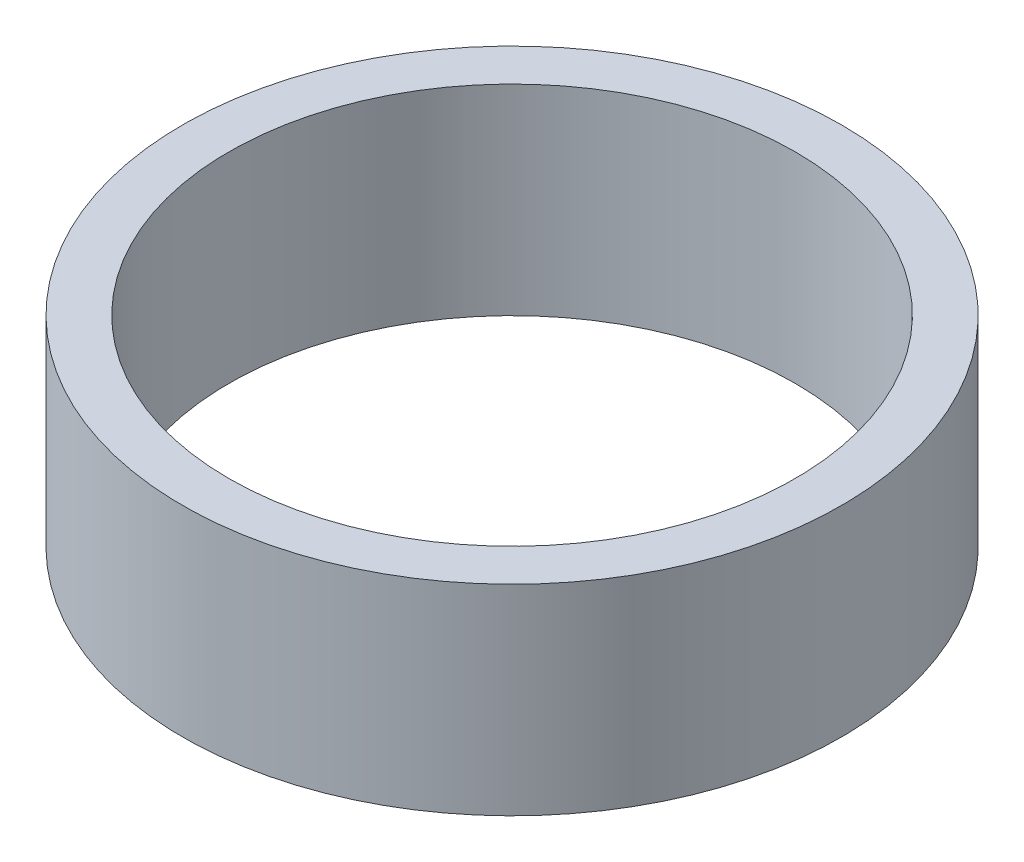
ISO-10303-21;
HEADER;
FILE_DESCRIPTION(('STEP AP214'),'2;1');
FILE_NAME('part.step','',(''),(''),'','','');
FILE_SCHEMA(('AUTOMOTIVE_DESIGN { 1 0 10303 214 1 1 1 1 }'));
ENDSEC;
DATA;
#1=APPLICATION_CONTEXT('core data for automotive mechanical design processes');
#2=APPLICATION_PROTOCOL_DEFINITION('international standard','automotive_design',2000,#1);
#3=PRODUCT_CONTEXT('',#1,'mechanical');
#4=PRODUCT('Part','Part','',(#3));
#5=PRODUCT_RELATED_PRODUCT_CATEGORY('part','',(#4));
#6=PRODUCT_DEFINITION_FORMATION('','',#4);
#7=PRODUCT_DEFINITION_CONTEXT('part definition',#1,'design');
#8=PRODUCT_DEFINITION('design','',#6,#7);
#9=PRODUCT_DEFINITION_SHAPE('','',#8);
#10=(LENGTH_UNIT() NAMED_UNIT(*) SI_UNIT(.MILLI.,.METRE.));
#11=(NAMED_UNIT(*) PLANE_ANGLE_UNIT() SI_UNIT($,.RADIAN.));
#12=(NAMED_UNIT(*) SI_UNIT($,.STERADIAN.) SOLID_ANGLE_UNIT());
#13=UNCERTAINTY_MEASURE_WITH_UNIT(LENGTH_MEASURE(1.E-05),#10,'distance_accuracy_value','');
#14=(GEOMETRIC_REPRESENTATION_CONTEXT(3) GLOBAL_UNCERTAINTY_ASSIGNED_CONTEXT((#13)) GLOBAL_UNIT_ASSIGNED_CONTEXT((#10,
#11,#12)) REPRESENTATION_CONTEXT('',''));
#15=CARTESIAN_POINT('',(0.,0.,0.));
#16=DIRECTION('',(0.,0.,1.));
#17=DIRECTION('',(1.,0.,0.));
#18=AXIS2_PLACEMENT_3D('',#15,#16,#17);
#19=CARTESIAN_POINT('',(0.,13.6926559928297,0.));
#20=DIRECTION('',(0.,-1.,0.));
#21=DIRECTION('',(0.,0.,-1.));
#22=AXIS2_PLACEMENT_3D('',#19,#20,#21);
#23=CYLINDRICAL_SURFACE('',#22,22.5);
#24=CARTESIAN_POINT('',(0.,13.6926559928297,0.));
#25=DIRECTION('',(0.,1.,0.));
#26=DIRECTION('',(0.,0.,1.));
#27=AXIS2_PLACEMENT_3D('',#24,#25,#26);
#28=CIRCLE('',#27,22.5);
#29=CARTESIAN_POINT('',(0.,13.6926559928297,-22.5));
#30=VERTEX_POINT('',#29);
#31=EDGE_CURVE('E10',#30,#30,#28,.T.);
#32=CARTESIAN_POINT('',(0.,0.,0.));
#33=DIRECTION('',(0.,1.,0.));
#34=DIRECTION('',(0.,0.,1.));
#35=AXIS2_PLACEMENT_3D('',#32,#33,#34);
#36=CIRCLE('',#35,22.5);
#37=CARTESIAN_POINT('',(0.,0.,-22.5));
#38=VERTEX_POINT('',#37);
#39=EDGE_CURVE('E37',#38,#38,#36,.T.);
#40=CARTESIAN_POINT('',(0.,13.6926559928297,-22.5));
#41=CARTESIAN_POINT('',(0.,13.5500241595711,-22.5));
#42=CARTESIAN_POINT('',(0.,13.4073923263124,-22.5));
#43=CARTESIAN_POINT('',(0.,13.1221286597951,-22.5));
#44=CARTESIAN_POINT('',(0.,12.9794968265365,-22.5));
#45=CARTESIAN_POINT('',(0.,12.6942331600192,-22.5));
#46=CARTESIAN_POINT('',(0.,12.5516013267606,-22.5));
#47=CARTESIAN_POINT('',(0.,12.2663376602433,-22.5));
#48=CARTESIAN_POINT('',(0.,12.1237058269846,-22.5));
#49=CARTESIAN_POINT('',(0.,11.8384421604673,-22.5));
#50=CARTESIAN_POINT('',(0.,11.6958103272087,-22.5));
#51=CARTESIAN_POINT('',(0.,11.4105466606914,-22.5));
#52=CARTESIAN_POINT('',(0.,11.2679148274328,-22.5));
#53=CARTESIAN_POINT('',(0.,10.9826511609155,-22.5));
#54=CARTESIAN_POINT('',(0.,10.8400193276568,-22.5));
#55=CARTESIAN_POINT('',(0.,10.5547556611396,-22.5));
#56=CARTESIAN_POINT('',(0.,10.4121238278809,-22.5));
#57=CARTESIAN_POINT('',(0.,10.1268601613636,-22.5));
#58=CARTESIAN_POINT('',(0.,9.98422832810498,-22.5));
#59=CARTESIAN_POINT('',(0.,9.6989646615877,-22.5));
#60=CARTESIAN_POINT('',(0.,9.55633282832906,-22.5));
#61=CARTESIAN_POINT('',(0.,9.27106916181177,-22.5));
#62=CARTESIAN_POINT('',(0.,9.12843732855313,-22.5));
#63=CARTESIAN_POINT('',(0.,8.84317366203584,-22.5));
#64=CARTESIAN_POINT('',(0.,8.7005418287772,-22.5));
#65=CARTESIAN_POINT('',(0.,8.41527816225992,-22.5));
#66=CARTESIAN_POINT('',(0.,8.27264632900127,-22.5));
#67=CARTESIAN_POINT('',(0.,7.98738266248399,-22.5));
#68=CARTESIAN_POINT('',(0.,7.84475082922535,-22.5));
#69=CARTESIAN_POINT('',(0.,7.55948716270806,-22.5));
#70=CARTESIAN_POINT('',(0.,7.41685532944942,-22.5));
#71=CARTESIAN_POINT('',(0.,7.13159166293213,-22.5));
#72=CARTESIAN_POINT('',(0.,6.98895982967349,-22.5));
#73=CARTESIAN_POINT('',(0.,6.7036961631562,-22.5));
#74=CARTESIAN_POINT('',(0.,6.56106432989756,-22.5));
#75=CARTESIAN_POINT('',(0.,6.27580066338028,-22.5));
#76=CARTESIAN_POINT('',(0.,6.13316883012163,-22.5));
#77=CARTESIAN_POINT('',(0.,5.84790516360435,-22.5));
#78=CARTESIAN_POINT('',(0.,5.70527333034571,-22.5));
#79=CARTESIAN_POINT('',(0.,5.42000966382842,-22.5));
#80=CARTESIAN_POINT('',(0.,5.27737783056978,-22.5));
#81=CARTESIAN_POINT('',(0.,4.99211416405249,-22.5));
#82=CARTESIAN_POINT('',(0.,4.84948233079385,-22.5));
#83=CARTESIAN_POINT('',(0.,4.56421866427656,-22.5));
#84=CARTESIAN_POINT('',(0.,4.42158683101792,-22.5));
#85=CARTESIAN_POINT('',(0.,4.13632316450064,-22.5));
#86=CARTESIAN_POINT('',(0.,3.99369133124199,-22.5));
#87=CARTESIAN_POINT('',(0.,3.70842766472471,-22.5));
#88=CARTESIAN_POINT('',(0.,3.56579583146607,-22.5));
#89=CARTESIAN_POINT('',(0.,3.28053216494878,-22.5));
#90=CARTESIAN_POINT('',(0.,3.13790033169014,-22.5));
#91=CARTESIAN_POINT('',(0.,2.85263666517285,-22.5));
#92=CARTESIAN_POINT('',(0.,2.71000483191421,-22.5));
#93=CARTESIAN_POINT('',(0.,2.42474116539692,-22.5));
#94=CARTESIAN_POINT('',(0.,2.28210933213828,-22.5));
#95=CARTESIAN_POINT('',(0.,1.996845665621,-22.5));
#96=CARTESIAN_POINT('',(0.,1.85421383236235,-22.5));
#97=CARTESIAN_POINT('',(0.,1.56895016584507,-22.5));
#98=CARTESIAN_POINT('',(0.,1.42631833258643,-22.5));
#99=CARTESIAN_POINT('',(0.,1.14105466606914,-22.5));
#100=CARTESIAN_POINT('',(0.,0.998422832810498,-22.5));
#101=CARTESIAN_POINT('',(0.,0.713159166293212,-22.5));
#102=CARTESIAN_POINT('',(0.,0.570527333034569,-22.5));
#103=CARTESIAN_POINT('',(0.,0.285263666517284,-22.5));
#104=CARTESIAN_POINT('',(0.,0.142631833258641,-22.5));
#105=CARTESIAN_POINT('',(0.,0.,-22.5));
#106=B_SPLINE_CURVE_WITH_KNOTS('',3,(#40,#41,#42,#43,#44,#45,#46,#47,#48,#49,#50,#51,#52,#53,
#54,#55,#56,#57,#58,#59,#60,#61,#62,#63,#64,#65,#66,#67,#68,#69,#70,#71,#72,#73,#74,#75,#76,#77,
#78,#79,#80,#81,#82,#83,#84,#85,#86,#87,#88,#89,#90,#91,#92,#93,#94,#95,#96,#97,#98,#99,#100,
#101,#102,#103,#104,#105),.UNSPECIFIED.,.F.,.F.,(4,2,2,2,2,2,2,2,2,2,2,2,2,2,2,2,2,2,2,2,2,2,2,
2,2,2,2,2,2,2,2,2,4),(0.,0.427895499775927,0.855790999551855,1.28368649932778,1.71158199910371,
2.13947749887964,2.56737299865557,2.99526849843149,3.42316399820742,3.85105949798335,
4.27895499775928,4.70685049753521,5.13474599731113,5.56264149708706,5.99053699686299,
6.41843249663892,6.84632799641485,7.27422349619077,7.7021189959667,8.13001449574263,
8.55790999551856,8.98580549529449,9.41370099507042,9.84159649484634,10.2694919946223,
10.6973874943982,11.1252829941741,11.5531784939501,11.981073993726,12.4089694935019,
12.8368649932778,13.2647604930538,13.6926559928297),.UNSPECIFIED.);
#107=EDGE_CURVE('BSEAM40',#30,#38,#106,.T.);
#108=ORIENTED_EDGE('',*,*,#31,.F.);
#109=ORIENTED_EDGE('',*,*,#39,.T.);
#110=ORIENTED_EDGE('',*,*,#107,.T.);
#111=ORIENTED_EDGE('',*,*,#107,.F.);
#112=EDGE_LOOP('',(#108,#110,#109,#111));
#113=FACE_BOUND('',#112,.T.);
#114=ADVANCED_FACE('F40',(#113),#23,.T.);
#115=CARTESIAN_POINT('',(0.,13.6926559928297,0.));
#116=DIRECTION('',(0.,1.,0.));
#117=DIRECTION('',(0.,0.,1.));
#118=AXIS2_PLACEMENT_3D('',#115,#116,#117);
#119=PLANE('',#118);
#120=CARTESIAN_POINT('',(0.,13.6926559928297,0.));
#121=DIRECTION('',(0.,1.,0.));
#122=DIRECTION('',(0.,0.,1.));
#123=AXIS2_PLACEMENT_3D('',#120,#121,#122);
#124=CIRCLE('',#123,19.3259621114039);
#125=CARTESIAN_POINT('',(0.,13.6926559928297,-19.3259621114039));
#126=VERTEX_POINT('',#125);
#127=EDGE_CURVE('E50',#126,#126,#124,.T.);
#128=ORIENTED_EDGE('',*,*,#127,.F.);
#129=EDGE_LOOP('',(#128));
#130=FACE_BOUND('',#129,.T.);
#131=ORIENTED_EDGE('',*,*,#31,.T.);
#132=EDGE_LOOP('',(#131));
#133=FACE_BOUND('',#132,.T.);
#134=ADVANCED_FACE('F59',(#130,#133),#119,.T.);
#135=CARTESIAN_POINT('',(0.,0.,0.));
#136=DIRECTION('',(0.,1.,0.));
#137=DIRECTION('',(0.,0.,1.));
#138=AXIS2_PLACEMENT_3D('',#135,#136,#137);
#139=PLANE('',#138);
#140=CARTESIAN_POINT('',(0.,0.,0.));
#141=DIRECTION('',(0.,1.,0.));
#142=DIRECTION('',(0.,0.,1.));
#143=AXIS2_PLACEMENT_3D('',#140,#141,#142);
#144=CIRCLE('',#143,19.3259621114039);
#145=CARTESIAN_POINT('',(0.,0.,-19.3259621114039));
#146=VERTEX_POINT('',#145);
#147=EDGE_CURVE('E47',#146,#146,#144,.T.);
#148=ORIENTED_EDGE('',*,*,#147,.T.);
#149=EDGE_LOOP('',(#148));
#150=FACE_BOUND('',#149,.T.);
#151=ORIENTED_EDGE('',*,*,#39,.F.);
#152=EDGE_LOOP('',(#151));
#153=FACE_BOUND('',#152,.T.);
#154=ADVANCED_FACE('F58',(#150,#153),#139,.F.);
#155=CARTESIAN_POINT('',(0.,13.6926559928297,0.));
#156=DIRECTION('',(0.,-1.,0.));
#157=DIRECTION('',(0.,0.,-1.));
#158=AXIS2_PLACEMENT_3D('',#155,#156,#157);
#159=CYLINDRICAL_SURFACE('',#158,19.3259621114039);
#160=CARTESIAN_POINT('',(0.,13.6926559928297,-19.3259621114039));
#161=CARTESIAN_POINT('',(0.,13.5500241595711,-19.3259621114039));
#162=CARTESIAN_POINT('',(0.,13.4073923263124,-19.3259621114039));
#163=CARTESIAN_POINT('',(0.,13.1221286597951,-19.3259621114039));
#164=CARTESIAN_POINT('',(0.,12.9794968265365,-19.3259621114039));
#165=CARTESIAN_POINT('',(0.,12.6942331600192,-19.3259621114039));
#166=CARTESIAN_POINT('',(0.,12.5516013267606,-19.3259621114039));
#167=CARTESIAN_POINT('',(0.,12.2663376602433,-19.3259621114039));
#168=CARTESIAN_POINT('',(0.,12.1237058269846,-19.3259621114039));
#169=CARTESIAN_POINT('',(0.,11.8384421604673,-19.3259621114039));
#170=CARTESIAN_POINT('',(0.,11.6958103272087,-19.3259621114039));
#171=CARTESIAN_POINT('',(0.,11.4105466606914,-19.3259621114039));
#172=CARTESIAN_POINT('',(0.,11.2679148274328,-19.3259621114039));
#173=CARTESIAN_POINT('',(0.,10.9826511609155,-19.3259621114039));
#174=CARTESIAN_POINT('',(0.,10.8400193276568,-19.3259621114039));
#175=CARTESIAN_POINT('',(0.,10.5547556611396,-19.3259621114039));
#176=CARTESIAN_POINT('',(0.,10.4121238278809,-19.3259621114039));
#177=CARTESIAN_POINT('',(0.,10.1268601613636,-19.3259621114039));
#178=CARTESIAN_POINT('',(0.,9.98422832810498,-19.3259621114039));
#179=CARTESIAN_POINT('',(0.,9.6989646615877,-19.3259621114039));
#180=CARTESIAN_POINT('',(0.,9.55633282832906,-19.3259621114039));
#181=CARTESIAN_POINT('',(0.,9.27106916181177,-19.3259621114039));
#182=CARTESIAN_POINT('',(0.,9.12843732855313,-19.3259621114039));
#183=CARTESIAN_POINT('',(0.,8.84317366203584,-19.3259621114039));
#184=CARTESIAN_POINT('',(0.,8.7005418287772,-19.3259621114039));
#185=CARTESIAN_POINT('',(0.,8.41527816225992,-19.3259621114039));
#186=CARTESIAN_POINT('',(0.,8.27264632900127,-19.3259621114039));
#187=CARTESIAN_POINT('',(0.,7.98738266248399,-19.3259621114039));
#188=CARTESIAN_POINT('',(0.,7.84475082922535,-19.3259621114039));
#189=CARTESIAN_POINT('',(0.,7.55948716270806,-19.3259621114039));
#190=CARTESIAN_POINT('',(0.,7.41685532944942,-19.3259621114039));
#191=CARTESIAN_POINT('',(0.,7.13159166293213,-19.3259621114039));
#192=CARTESIAN_POINT('',(0.,6.98895982967349,-19.3259621114039));
#193=CARTESIAN_POINT('',(0.,6.7036961631562,-19.3259621114039));
#194=CARTESIAN_POINT('',(0.,6.56106432989756,-19.3259621114039));
#195=CARTESIAN_POINT('',(0.,6.27580066338028,-19.3259621114039));
#196=CARTESIAN_POINT('',(0.,6.13316883012163,-19.3259621114039));
#197=CARTESIAN_POINT('',(0.,5.84790516360435,-19.3259621114039));
#198=CARTESIAN_POINT('',(0.,5.70527333034571,-19.3259621114039));
#199=CARTESIAN_POINT('',(0.,5.42000966382842,-19.3259621114039));
#200=CARTESIAN_POINT('',(0.,5.27737783056978,-19.3259621114039));
#201=CARTESIAN_POINT('',(0.,4.99211416405249,-19.3259621114039));
#202=CARTESIAN_POINT('',(0.,4.84948233079385,-19.3259621114039));
#203=CARTESIAN_POINT('',(0.,4.56421866427656,-19.3259621114039));
#204=CARTESIAN_POINT('',(0.,4.42158683101792,-19.3259621114039));
#205=CARTESIAN_POINT('',(0.,4.13632316450064,-19.3259621114039));
#206=CARTESIAN_POINT('',(0.,3.99369133124199,-19.3259621114039));
#207=CARTESIAN_POINT('',(0.,3.70842766472471,-19.3259621114039));
#208=CARTESIAN_POINT('',(0.,3.56579583146607,-19.3259621114039));
#209=CARTESIAN_POINT('',(0.,3.28053216494878,-19.3259621114039));
#210=CARTESIAN_POINT('',(0.,3.13790033169014,-19.3259621114039));
#211=CARTESIAN_POINT('',(0.,2.85263666517285,-19.3259621114039));
#212=CARTESIAN_POINT('',(0.,2.71000483191421,-19.3259621114039));
#213=CARTESIAN_POINT('',(0.,2.42474116539692,-19.3259621114039));
#214=CARTESIAN_POINT('',(0.,2.28210933213828,-19.3259621114039));
#215=CARTESIAN_POINT('',(0.,1.996845665621,-19.3259621114039));
#216=CARTESIAN_POINT('',(0.,1.85421383236235,-19.3259621114039));
#217=CARTESIAN_POINT('',(0.,1.56895016584507,-19.3259621114039));
#218=CARTESIAN_POINT('',(0.,1.42631833258643,-19.3259621114039));
#219=CARTESIAN_POINT('',(0.,1.14105466606914,-19.3259621114039));
#220=CARTESIAN_POINT('',(0.,0.998422832810498,-19.3259621114039));
#221=CARTESIAN_POINT('',(0.,0.713159166293212,-19.3259621114039));
#222=CARTESIAN_POINT('',(0.,0.570527333034569,-19.3259621114039));
#223=CARTESIAN_POINT('',(0.,0.285263666517284,-19.3259621114039));
#224=CARTESIAN_POINT('',(0.,0.142631833258641,-19.3259621114039));
#225=CARTESIAN_POINT('',(0.,0.,-19.3259621114039));
#226=B_SPLINE_CURVE_WITH_KNOTS('',3,(#160,#161,#162,#163,#164,#165,#166,#167,#168,#169,#170,
#171,#172,#173,#174,#175,#176,#177,#178,#179,#180,#181,#182,#183,#184,#185,#186,#187,#188,#189,
#190,#191,#192,#193,#194,#195,#196,#197,#198,#199,#200,#201,#202,#203,#204,#205,#206,#207,#208,
#209,#210,#211,#212,#213,#214,#215,#216,#217,#218,#219,#220,#221,#222,#223,#224,#225),
.UNSPECIFIED.,.F.,.F.,(4,2,2,2,2,2,2,2,2,2,2,2,2,2,2,2,2,2,2,2,2,2,2,2,2,2,2,2,2,2,2,2,4),(0.,
0.427895499775927,0.855790999551855,1.28368649932778,1.71158199910371,2.13947749887964,
2.56737299865557,2.99526849843149,3.42316399820742,3.85105949798335,4.27895499775928,
4.70685049753521,5.13474599731113,5.56264149708706,5.99053699686299,6.41843249663892,
6.84632799641485,7.27422349619077,7.7021189959667,8.13001449574263,8.55790999551856,
8.98580549529449,9.41370099507042,9.84159649484634,10.2694919946223,10.6973874943982,
11.1252829941741,11.5531784939501,11.981073993726,12.4089694935019,12.8368649932778,
13.2647604930538,13.6926559928297),.UNSPECIFIED.);
#227=EDGE_CURVE('BSEAM54',#126,#146,#226,.T.);
#228=ORIENTED_EDGE('',*,*,#127,.T.);
#229=ORIENTED_EDGE('',*,*,#147,.F.);
#230=ORIENTED_EDGE('',*,*,#227,.T.);
#231=ORIENTED_EDGE('',*,*,#227,.F.);
#232=EDGE_LOOP('',(#228,#230,#229,#231));
#233=FACE_BOUND('',#232,.T.);
#234=ADVANCED_FACE('F54',(#233),#159,.F.);
#235=CLOSED_SHELL('',(#114,#134,#154,#234));
#236=MANIFOLD_SOLID_BREP('B2',#235);
#237=ADVANCED_BREP_SHAPE_REPRESENTATION('',(#18,#236),#14);
#238=SHAPE_DEFINITION_REPRESENTATION(#9,#237);
ENDSEC;
END-ISO-10303-21;
